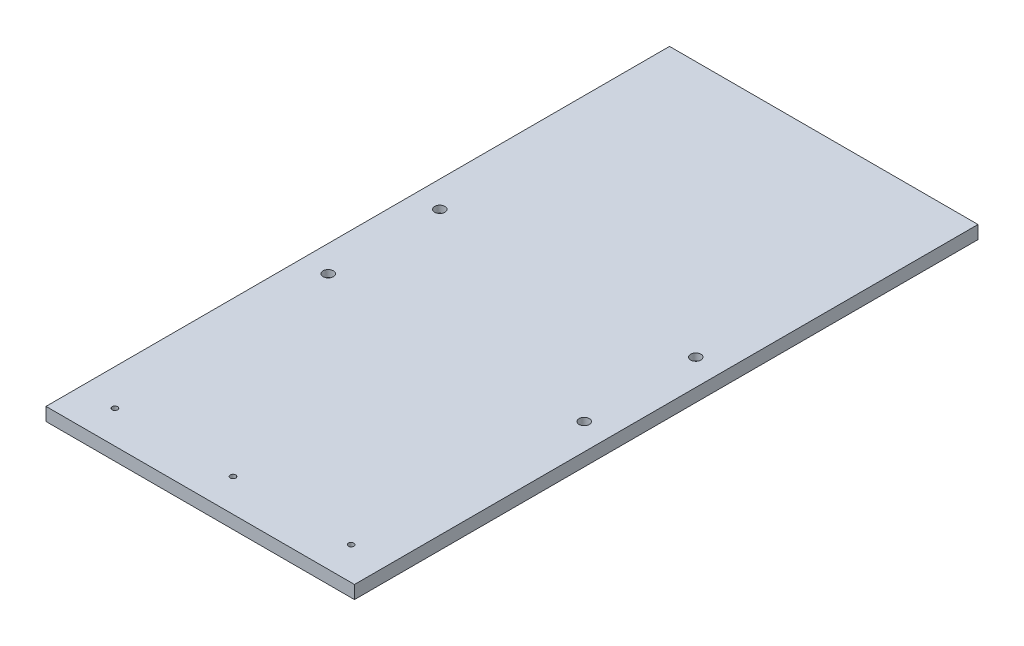
ISO-10303-21;
HEADER;
FILE_DESCRIPTION(('STEP AP214'),'2;1');
FILE_NAME('part.step','',(''),(''),'','','');
FILE_SCHEMA(('AUTOMOTIVE_DESIGN { 1 0 10303 214 1 1 1 1 }'));
ENDSEC;
DATA;
#1=APPLICATION_CONTEXT('core data for automotive mechanical design processes');
#2=APPLICATION_PROTOCOL_DEFINITION('international standard','automotive_design',2000,#1);
#3=PRODUCT_CONTEXT('',#1,'mechanical');
#4=PRODUCT('Part','Part','',(#3));
#5=PRODUCT_RELATED_PRODUCT_CATEGORY('part','',(#4));
#6=PRODUCT_DEFINITION_FORMATION('','',#4);
#7=PRODUCT_DEFINITION_CONTEXT('part definition',#1,'design');
#8=PRODUCT_DEFINITION('design','',#6,#7);
#9=PRODUCT_DEFINITION_SHAPE('','',#8);
#10=(LENGTH_UNIT() NAMED_UNIT(*) SI_UNIT(.MILLI.,.METRE.));
#11=(NAMED_UNIT(*) PLANE_ANGLE_UNIT() SI_UNIT($,.RADIAN.));
#12=(NAMED_UNIT(*) SI_UNIT($,.STERADIAN.) SOLID_ANGLE_UNIT());
#13=UNCERTAINTY_MEASURE_WITH_UNIT(LENGTH_MEASURE(1.E-05),#10,'distance_accuracy_value','');
#14=(GEOMETRIC_REPRESENTATION_CONTEXT(3) GLOBAL_UNCERTAINTY_ASSIGNED_CONTEXT((#13)) GLOBAL_UNIT_ASSIGNED_CONTEXT((#10,
#11,#12)) REPRESENTATION_CONTEXT('',''));
#15=CARTESIAN_POINT('',(0.,0.,0.));
#16=DIRECTION('',(0.,0.,1.));
#17=DIRECTION('',(1.,0.,0.));
#18=AXIS2_PLACEMENT_3D('',#15,#16,#17);
#19=CARTESIAN_POINT('',(123.825,-7.64579372036778E-13,53.975));
#20=DIRECTION('',(0.,-1.,0.));
#21=DIRECTION('',(0.,0.,-1.));
#22=AXIS2_PLACEMENT_3D('',#19,#20,#21);
#23=CONICAL_SURFACE('',#22,10.1345999999991,0.71558499331754);
#24=CARTESIAN_POINT('',(123.825,5.9461392600853,53.975));
#25=DIRECTION('',(0.,-1.,0.));
#26=DIRECTION('',(0.,0.,-1.));
#27=AXIS2_PLACEMENT_3D('',#24,#25,#26);
#28=CIRCLE('',#27,4.9657);
#29=CARTESIAN_POINT('',(123.825,5.9461392600853,49.0093));
#30=VERTEX_POINT('',#29);
#31=EDGE_CURVE('E93',#30,#30,#28,.F.);
#32=ORIENTED_EDGE('',*,*,#31,.T.);
#33=EDGE_LOOP('',(#32));
#34=FACE_BOUND('',#33,.T.);
#35=CARTESIAN_POINT('',(123.825,-7.56773116394882E-13,53.975));
#36=DIRECTION('',(0.,-1.,0.));
#37=DIRECTION('',(0.,0.,-1.));
#38=AXIS2_PLACEMENT_3D('',#35,#36,#37);
#39=CIRCLE('',#38,10.1345999999991);
#40=CARTESIAN_POINT('',(123.825,-7.56773116394882E-13,43.8404000000009));
#41=VERTEX_POINT('',#40);
#42=EDGE_CURVE('E20',#41,#41,#39,.T.);
#43=ORIENTED_EDGE('',*,*,#42,.T.);
#44=EDGE_LOOP('',(#43));
#45=FACE_BOUND('',#44,.T.);
#46=ADVANCED_FACE('F17',(#34,#45),#23,.F.);
#47=CARTESIAN_POINT('',(123.825,-7.64579372036778E-13,-53.975));
#48=DIRECTION('',(0.,-1.,0.));
#49=DIRECTION('',(0.,0.,-1.));
#50=AXIS2_PLACEMENT_3D('',#47,#48,#49);
#51=CONICAL_SURFACE('',#50,10.1345999999991,0.71558499331754);
#52=CARTESIAN_POINT('',(123.825,5.9461392600853,-53.975));
#53=DIRECTION('',(0.,-1.,0.));
#54=DIRECTION('',(0.,0.,-1.));
#55=AXIS2_PLACEMENT_3D('',#52,#53,#54);
#56=CIRCLE('',#55,4.9657);
#57=CARTESIAN_POINT('',(123.825,5.9461392600853,-58.9407));
#58=VERTEX_POINT('',#57);
#59=EDGE_CURVE('E90',#58,#58,#56,.F.);
#60=ORIENTED_EDGE('',*,*,#59,.T.);
#61=EDGE_LOOP('',(#60));
#62=FACE_BOUND('',#61,.T.);
#63=CARTESIAN_POINT('',(123.825,-7.56773116394882E-13,-53.975));
#64=DIRECTION('',(0.,-1.,0.));
#65=DIRECTION('',(0.,0.,-1.));
#66=AXIS2_PLACEMENT_3D('',#63,#64,#65);
#67=CIRCLE('',#66,10.1345999999991);
#68=CARTESIAN_POINT('',(123.825,-7.56773116394882E-13,-64.1095999999991));
#69=VERTEX_POINT('',#68);
#70=EDGE_CURVE('E128',#69,#69,#67,.T.);
#71=ORIENTED_EDGE('',*,*,#70,.T.);
#72=EDGE_LOOP('',(#71));
#73=FACE_BOUND('',#72,.T.);
#74=ADVANCED_FACE('F286',(#62,#73),#51,.F.);
#75=CARTESIAN_POINT('',(-123.825,-7.59375201608847E-13,53.975));
#76=DIRECTION('',(0.,-1.,0.));
#77=DIRECTION('',(0.,0.,-1.));
#78=AXIS2_PLACEMENT_3D('',#75,#76,#77);
#79=CONICAL_SURFACE('',#78,10.1345999999991,0.715584993317541);
#80=CARTESIAN_POINT('',(-123.825,5.9461392600853,53.975));
#81=DIRECTION('',(0.,-1.,0.));
#82=DIRECTION('',(0.,0.,-1.));
#83=AXIS2_PLACEMENT_3D('',#80,#81,#82);
#84=CIRCLE('',#83,4.9657);
#85=CARTESIAN_POINT('',(-123.825,5.9461392600853,49.0093));
#86=VERTEX_POINT('',#85);
#87=EDGE_CURVE('E87',#86,#86,#84,.F.);
#88=ORIENTED_EDGE('',*,*,#87,.T.);
#89=EDGE_LOOP('',(#88));
#90=FACE_BOUND('',#89,.T.);
#91=CARTESIAN_POINT('',(-123.825,-7.52869988573934E-13,53.975));
#92=DIRECTION('',(0.,-1.,0.));
#93=DIRECTION('',(0.,0.,-1.));
#94=AXIS2_PLACEMENT_3D('',#91,#92,#93);
#95=CIRCLE('',#94,10.1345999999991);
#96=CARTESIAN_POINT('',(-123.825,-7.52869988573934E-13,43.8404000000009));
#97=VERTEX_POINT('',#96);
#98=EDGE_CURVE('E126',#97,#97,#95,.T.);
#99=ORIENTED_EDGE('',*,*,#98,.T.);
#100=EDGE_LOOP('',(#99));
#101=FACE_BOUND('',#100,.T.);
#102=ADVANCED_FACE('F146',(#90,#101),#79,.F.);
#103=CARTESIAN_POINT('',(-123.825,-7.59375201608847E-13,-53.975));
#104=DIRECTION('',(0.,-1.,0.));
#105=DIRECTION('',(0.,0.,-1.));
#106=AXIS2_PLACEMENT_3D('',#103,#104,#105);
#107=CONICAL_SURFACE('',#106,10.1345999999991,0.715584993317541);
#108=CARTESIAN_POINT('',(-123.825,5.9461392600853,-53.975));
#109=DIRECTION('',(0.,-1.,0.));
#110=DIRECTION('',(0.,0.,-1.));
#111=AXIS2_PLACEMENT_3D('',#108,#109,#110);
#112=CIRCLE('',#111,4.9657);
#113=CARTESIAN_POINT('',(-123.825,5.9461392600853,-58.9407));
#114=VERTEX_POINT('',#113);
#115=EDGE_CURVE('E83',#114,#114,#112,.F.);
#116=ORIENTED_EDGE('',*,*,#115,.T.);
#117=EDGE_LOOP('',(#116));
#118=FACE_BOUND('',#117,.T.);
#119=CARTESIAN_POINT('',(-123.825,-7.52869988573934E-13,-53.975));
#120=DIRECTION('',(0.,-1.,0.));
#121=DIRECTION('',(0.,0.,-1.));
#122=AXIS2_PLACEMENT_3D('',#119,#120,#121);
#123=CIRCLE('',#122,10.1345999999991);
#124=CARTESIAN_POINT('',(-123.825,-7.52869988573934E-13,-64.1095999999991));
#125=VERTEX_POINT('',#124);
#126=EDGE_CURVE('E69',#125,#125,#123,.T.);
#127=ORIENTED_EDGE('',*,*,#126,.T.);
#128=EDGE_LOOP('',(#127));
#129=FACE_BOUND('',#128,.T.);
#130=ADVANCED_FACE('F137',(#118,#129),#107,.F.);
#131=CARTESIAN_POINT('',(0.,0.,0.));
#132=DIRECTION('',(0.,1.,0.));
#133=DIRECTION('',(0.,0.,1.));
#134=AXIS2_PLACEMENT_3D('',#131,#132,#133);
#135=PLANE('',#134);
#136=CARTESIAN_POINT('',(114.3,0.,269.875));
#137=DIRECTION('',(0.,1.,0.));
#138=DIRECTION('',(0.,0.,1.));
#139=AXIS2_PLACEMENT_3D('',#136,#137,#138);
#140=CIRCLE('',#139,2.667);
#141=CARTESIAN_POINT('',(114.3,0.,272.542));
#142=VERTEX_POINT('',#141);
#143=EDGE_CURVE('E115',#142,#142,#140,.T.);
#144=ORIENTED_EDGE('',*,*,#143,.T.);
#145=EDGE_LOOP('',(#144));
#146=FACE_BOUND('',#145,.T.);
#147=CARTESIAN_POINT('',(0.,0.,269.875));
#148=DIRECTION('',(0.,1.,0.));
#149=DIRECTION('',(0.,0.,1.));
#150=AXIS2_PLACEMENT_3D('',#147,#148,#149);
#151=CIRCLE('',#150,2.667);
#152=CARTESIAN_POINT('',(0.,0.,272.542));
#153=VERTEX_POINT('',#152);
#154=EDGE_CURVE('E119',#153,#153,#151,.T.);
#155=ORIENTED_EDGE('',*,*,#154,.T.);
#156=EDGE_LOOP('',(#155));
#157=FACE_BOUND('',#156,.T.);
#158=CARTESIAN_POINT('',(-114.3,0.,269.875));
#159=DIRECTION('',(0.,1.,0.));
#160=DIRECTION('',(0.,0.,1.));
#161=AXIS2_PLACEMENT_3D('',#158,#159,#160);
#162=CIRCLE('',#161,2.667);
#163=CARTESIAN_POINT('',(-114.3,0.,272.542));
#164=VERTEX_POINT('',#163);
#165=EDGE_CURVE('E86',#164,#164,#162,.T.);
#166=ORIENTED_EDGE('',*,*,#165,.T.);
#167=EDGE_LOOP('',(#166));
#168=FACE_BOUND('',#167,.T.);
#169=ORIENTED_EDGE('',*,*,#126,.F.);
#170=EDGE_LOOP('',(#169));
#171=FACE_BOUND('',#170,.T.);
#172=ORIENTED_EDGE('',*,*,#98,.F.);
#173=EDGE_LOOP('',(#172));
#174=FACE_BOUND('',#173,.T.);
#175=ORIENTED_EDGE('',*,*,#70,.F.);
#176=EDGE_LOOP('',(#175));
#177=FACE_BOUND('',#176,.T.);
#178=ORIENTED_EDGE('',*,*,#42,.F.);
#179=EDGE_LOOP('',(#178));
#180=FACE_BOUND('',#179,.T.);
#181=DIRECTION('',(-1.,0.,0.));
#182=VECTOR('',#181,1.);
#183=CARTESIAN_POINT('',(149.225,0.,-301.625));
#184=LINE('',#183,#182);
#185=CARTESIAN_POINT('',(149.225,0.,-301.625));
#186=VERTEX_POINT('',#185);
#187=CARTESIAN_POINT('',(-149.225,0.,-301.625));
#188=VERTEX_POINT('',#187);
#189=EDGE_CURVE('E55',#186,#188,#184,.T.);
#190=ORIENTED_EDGE('',*,*,#189,.F.);
#191=DIRECTION('',(0.,0.,-1.));
#192=VECTOR('',#191,1.);
#193=CARTESIAN_POINT('',(149.225,0.,301.625));
#194=LINE('',#193,#192);
#195=CARTESIAN_POINT('',(149.225,0.,301.625));
#196=VERTEX_POINT('',#195);
#197=EDGE_CURVE('E60',#196,#186,#194,.T.);
#198=ORIENTED_EDGE('',*,*,#197,.F.);
#199=DIRECTION('',(1.,0.,0.));
#200=VECTOR('',#199,1.);
#201=CARTESIAN_POINT('',(-149.225,0.,301.625));
#202=LINE('',#201,#200);
#203=CARTESIAN_POINT('',(-149.225,0.,301.625));
#204=VERTEX_POINT('',#203);
#205=EDGE_CURVE('E95',#204,#196,#202,.T.);
#206=ORIENTED_EDGE('',*,*,#205,.F.);
#207=DIRECTION('',(0.,0.,1.));
#208=VECTOR('',#207,1.);
#209=CARTESIAN_POINT('',(-149.225,0.,-301.625));
#210=LINE('',#209,#208);
#211=EDGE_CURVE('E72',#188,#204,#210,.T.);
#212=ORIENTED_EDGE('',*,*,#211,.F.);
#213=EDGE_LOOP('',(#190,#198,#206,#212));
#214=FACE_BOUND('',#213,.T.);
#215=ADVANCED_FACE('F71',(#146,#157,#168,#171,#174,#177,#180,#214),#135,.F.);
#216=CARTESIAN_POINT('',(149.225,0.,301.625));
#217=DIRECTION('',(1.,0.,0.));
#218=DIRECTION('',(0.,0.,-1.));
#219=AXIS2_PLACEMENT_3D('',#216,#217,#218);
#220=PLANE('',#219);
#221=DIRECTION('',(0.,1.,0.));
#222=VECTOR('',#221,1.);
#223=CARTESIAN_POINT('',(149.225,0.,301.625));
#224=LINE('',#223,#222);
#225=CARTESIAN_POINT('',(149.225,12.7,301.625));
#226=VERTEX_POINT('',#225);
#227=EDGE_CURVE('E65',#196,#226,#224,.T.);
#228=ORIENTED_EDGE('',*,*,#227,.F.);
#229=ORIENTED_EDGE('',*,*,#197,.T.);
#230=DIRECTION('',(0.,1.,0.));
#231=VECTOR('',#230,1.);
#232=CARTESIAN_POINT('',(149.225,0.,-301.625));
#233=LINE('',#232,#231);
#234=CARTESIAN_POINT('',(149.225,12.7,-301.625));
#235=VERTEX_POINT('',#234);
#236=EDGE_CURVE('E62',#235,#186,#233,.F.);
#237=ORIENTED_EDGE('',*,*,#236,.F.);
#238=DIRECTION('',(0.,0.,1.));
#239=VECTOR('',#238,1.);
#240=CARTESIAN_POINT('',(149.225,12.7,0.));
#241=LINE('',#240,#239);
#242=EDGE_CURVE('E118',#226,#235,#241,.F.);
#243=ORIENTED_EDGE('',*,*,#242,.F.);
#244=EDGE_LOOP('',(#228,#229,#237,#243));
#245=FACE_BOUND('',#244,.T.);
#246=ADVANCED_FACE('F61',(#245),#220,.T.);
#247=CARTESIAN_POINT('',(149.225,0.,-301.625));
#248=DIRECTION('',(0.,0.,-1.));
#249=DIRECTION('',(-1.,0.,0.));
#250=AXIS2_PLACEMENT_3D('',#247,#248,#249);
#251=PLANE('',#250);
#252=ORIENTED_EDGE('',*,*,#236,.T.);
#253=ORIENTED_EDGE('',*,*,#189,.T.);
#254=DIRECTION('',(0.,1.,0.));
#255=VECTOR('',#254,1.);
#256=CARTESIAN_POINT('',(-149.225,0.,-301.625));
#257=LINE('',#256,#255);
#258=CARTESIAN_POINT('',(-149.225,12.7,-301.625));
#259=VERTEX_POINT('',#258);
#260=EDGE_CURVE('E74',#259,#188,#257,.F.);
#261=ORIENTED_EDGE('',*,*,#260,.F.);
#262=DIRECTION('',(1.,0.,0.));
#263=VECTOR('',#262,1.);
#264=CARTESIAN_POINT('',(0.,12.7,-301.625));
#265=LINE('',#264,#263);
#266=EDGE_CURVE('E78',#235,#259,#265,.F.);
#267=ORIENTED_EDGE('',*,*,#266,.F.);
#268=EDGE_LOOP('',(#252,#253,#261,#267));
#269=FACE_BOUND('',#268,.T.);
#270=ADVANCED_FACE('F76',(#269),#251,.T.);
#271=CARTESIAN_POINT('',(-149.225,0.,-301.625));
#272=DIRECTION('',(-1.,0.,0.));
#273=DIRECTION('',(0.,0.,1.));
#274=AXIS2_PLACEMENT_3D('',#271,#272,#273);
#275=PLANE('',#274);
#276=ORIENTED_EDGE('',*,*,#260,.T.);
#277=ORIENTED_EDGE('',*,*,#211,.T.);
#278=DIRECTION('',(0.,1.,0.));
#279=VECTOR('',#278,1.);
#280=CARTESIAN_POINT('',(-149.225,0.,301.625));
#281=LINE('',#280,#279);
#282=CARTESIAN_POINT('',(-149.225,12.7,301.625));
#283=VERTEX_POINT('',#282);
#284=EDGE_CURVE('E35',#283,#204,#281,.F.);
#285=ORIENTED_EDGE('',*,*,#284,.F.);
#286=DIRECTION('',(0.,0.,1.));
#287=VECTOR('',#286,1.);
#288=CARTESIAN_POINT('',(-149.225,12.7,0.));
#289=LINE('',#288,#287);
#290=EDGE_CURVE('E314',#259,#283,#289,.T.);
#291=ORIENTED_EDGE('',*,*,#290,.F.);
#292=EDGE_LOOP('',(#276,#277,#285,#291));
#293=FACE_BOUND('',#292,.T.);
#294=ADVANCED_FACE('F189',(#293),#275,.T.);
#295=CARTESIAN_POINT('',(-149.225,0.,301.625));
#296=DIRECTION('',(0.,0.,1.));
#297=DIRECTION('',(1.,0.,0.));
#298=AXIS2_PLACEMENT_3D('',#295,#296,#297);
#299=PLANE('',#298);
#300=ORIENTED_EDGE('',*,*,#284,.T.);
#301=ORIENTED_EDGE('',*,*,#205,.T.);
#302=ORIENTED_EDGE('',*,*,#227,.T.);
#303=DIRECTION('',(1.,0.,0.));
#304=VECTOR('',#303,1.);
#305=CARTESIAN_POINT('',(0.,12.7,301.625));
#306=LINE('',#305,#304);
#307=EDGE_CURVE('E114',#283,#226,#306,.T.);
#308=ORIENTED_EDGE('',*,*,#307,.F.);
#309=EDGE_LOOP('',(#300,#301,#302,#308));
#310=FACE_BOUND('',#309,.T.);
#311=ADVANCED_FACE('F185',(#310),#299,.T.);
#312=CARTESIAN_POINT('',(123.825,14.6685,53.975));
#313=DIRECTION('',(0.,-1.,0.));
#314=DIRECTION('',(0.,0.,-1.));
#315=AXIS2_PLACEMENT_3D('',#312,#313,#314);
#316=CYLINDRICAL_SURFACE('',#315,4.9657);
#317=ORIENTED_EDGE('',*,*,#31,.F.);
#318=EDGE_LOOP('',(#317));
#319=FACE_BOUND('',#318,.T.);
#320=CARTESIAN_POINT('',(123.825,12.7,53.975));
#321=DIRECTION('',(0.,-1.,0.));
#322=DIRECTION('',(0.,0.,-1.));
#323=AXIS2_PLACEMENT_3D('',#320,#321,#322);
#324=CIRCLE('',#323,4.9657);
#325=CARTESIAN_POINT('',(123.825,12.7,49.0093));
#326=VERTEX_POINT('',#325);
#327=EDGE_CURVE('E111',#326,#326,#324,.T.);
#328=ORIENTED_EDGE('',*,*,#327,.F.);
#329=EDGE_LOOP('',(#328));
#330=FACE_BOUND('',#329,.T.);
#331=ADVANCED_FACE('F181',(#319,#330),#316,.F.);
#332=CARTESIAN_POINT('',(123.825,14.6685,-53.975));
#333=DIRECTION('',(0.,-1.,0.));
#334=DIRECTION('',(0.,0.,-1.));
#335=AXIS2_PLACEMENT_3D('',#332,#333,#334);
#336=CYLINDRICAL_SURFACE('',#335,4.9657);
#337=ORIENTED_EDGE('',*,*,#59,.F.);
#338=EDGE_LOOP('',(#337));
#339=FACE_BOUND('',#338,.T.);
#340=CARTESIAN_POINT('',(123.825,12.7,-53.975));
#341=DIRECTION('',(0.,-1.,0.));
#342=DIRECTION('',(0.,0.,-1.));
#343=AXIS2_PLACEMENT_3D('',#340,#341,#342);
#344=CIRCLE('',#343,4.9657);
#345=CARTESIAN_POINT('',(123.825,12.7,-58.9407));
#346=VERTEX_POINT('',#345);
#347=EDGE_CURVE('E108',#346,#346,#344,.T.);
#348=ORIENTED_EDGE('',*,*,#347,.F.);
#349=EDGE_LOOP('',(#348));
#350=FACE_BOUND('',#349,.T.);
#351=ADVANCED_FACE('F177',(#339,#350),#336,.F.);
#352=CARTESIAN_POINT('',(-123.825,14.6685,53.975));
#353=DIRECTION('',(0.,-1.,0.));
#354=DIRECTION('',(0.,0.,-1.));
#355=AXIS2_PLACEMENT_3D('',#352,#353,#354);
#356=CYLINDRICAL_SURFACE('',#355,4.9657);
#357=ORIENTED_EDGE('',*,*,#87,.F.);
#358=EDGE_LOOP('',(#357));
#359=FACE_BOUND('',#358,.T.);
#360=CARTESIAN_POINT('',(-123.825,12.7,53.975));
#361=DIRECTION('',(0.,-1.,0.));
#362=DIRECTION('',(0.,0.,-1.));
#363=AXIS2_PLACEMENT_3D('',#360,#361,#362);
#364=CIRCLE('',#363,4.9657);
#365=CARTESIAN_POINT('',(-123.825,12.7,49.0093));
#366=VERTEX_POINT('',#365);
#367=EDGE_CURVE('E105',#366,#366,#364,.T.);
#368=ORIENTED_EDGE('',*,*,#367,.F.);
#369=EDGE_LOOP('',(#368));
#370=FACE_BOUND('',#369,.T.);
#371=ADVANCED_FACE('F173',(#359,#370),#356,.F.);
#372=CARTESIAN_POINT('',(-123.825,14.6685,-53.975));
#373=DIRECTION('',(0.,-1.,0.));
#374=DIRECTION('',(0.,0.,-1.));
#375=AXIS2_PLACEMENT_3D('',#372,#373,#374);
#376=CYLINDRICAL_SURFACE('',#375,4.9657);
#377=ORIENTED_EDGE('',*,*,#115,.F.);
#378=EDGE_LOOP('',(#377));
#379=FACE_BOUND('',#378,.T.);
#380=CARTESIAN_POINT('',(-123.825,12.7,-53.975));
#381=DIRECTION('',(0.,-1.,0.));
#382=DIRECTION('',(0.,0.,-1.));
#383=AXIS2_PLACEMENT_3D('',#380,#381,#382);
#384=CIRCLE('',#383,4.9657);
#385=CARTESIAN_POINT('',(-123.825,12.7,-58.9407));
#386=VERTEX_POINT('',#385);
#387=EDGE_CURVE('E102',#386,#386,#384,.T.);
#388=ORIENTED_EDGE('',*,*,#387,.F.);
#389=EDGE_LOOP('',(#388));
#390=FACE_BOUND('',#389,.T.);
#391=ADVANCED_FACE('F169',(#379,#390),#376,.F.);
#392=CARTESIAN_POINT('',(-114.3,12.7,269.875));
#393=DIRECTION('',(0.,1.,0.));
#394=DIRECTION('',(0.,0.,1.));
#395=AXIS2_PLACEMENT_3D('',#392,#393,#394);
#396=CYLINDRICAL_SURFACE('',#395,2.667);
#397=CARTESIAN_POINT('',(-114.3,12.7,269.875));
#398=DIRECTION('',(0.,1.,0.));
#399=DIRECTION('',(0.,0.,1.));
#400=AXIS2_PLACEMENT_3D('',#397,#398,#399);
#401=CIRCLE('',#400,2.667);
#402=CARTESIAN_POINT('',(-114.3,12.7,272.542));
#403=VERTEX_POINT('',#402);
#404=EDGE_CURVE('E99',#403,#403,#401,.F.);
#405=ORIENTED_EDGE('',*,*,#404,.F.);
#406=EDGE_LOOP('',(#405));
#407=FACE_BOUND('',#406,.T.);
#408=ORIENTED_EDGE('',*,*,#165,.F.);
#409=EDGE_LOOP('',(#408));
#410=FACE_BOUND('',#409,.T.);
#411=ADVANCED_FACE('F165',(#407,#410),#396,.F.);
#412=CARTESIAN_POINT('',(0.,12.7,269.875));
#413=DIRECTION('',(0.,1.,0.));
#414=DIRECTION('',(0.,0.,1.));
#415=AXIS2_PLACEMENT_3D('',#412,#413,#414);
#416=CYLINDRICAL_SURFACE('',#415,2.667);
#417=CARTESIAN_POINT('',(0.,12.7,269.875));
#418=DIRECTION('',(0.,1.,0.));
#419=DIRECTION('',(0.,0.,1.));
#420=AXIS2_PLACEMENT_3D('',#417,#418,#419);
#421=CIRCLE('',#420,2.667);
#422=CARTESIAN_POINT('',(0.,12.7,272.542));
#423=VERTEX_POINT('',#422);
#424=EDGE_CURVE('E26',#423,#423,#421,.F.);
#425=ORIENTED_EDGE('',*,*,#424,.F.);
#426=EDGE_LOOP('',(#425));
#427=FACE_BOUND('',#426,.T.);
#428=ORIENTED_EDGE('',*,*,#154,.F.);
#429=EDGE_LOOP('',(#428));
#430=FACE_BOUND('',#429,.T.);
#431=ADVANCED_FACE('F158',(#427,#430),#416,.F.);
#432=CARTESIAN_POINT('',(114.3,12.7,269.875));
#433=DIRECTION('',(0.,1.,0.));
#434=DIRECTION('',(0.,0.,1.));
#435=AXIS2_PLACEMENT_3D('',#432,#433,#434);
#436=CYLINDRICAL_SURFACE('',#435,2.667);
#437=CARTESIAN_POINT('',(114.3,12.7,269.875));
#438=DIRECTION('',(0.,1.,0.));
#439=DIRECTION('',(0.,0.,1.));
#440=AXIS2_PLACEMENT_3D('',#437,#438,#439);
#441=CIRCLE('',#440,2.667);
#442=CARTESIAN_POINT('',(114.3,12.7,272.542));
#443=VERTEX_POINT('',#442);
#444=EDGE_CURVE('E11',#443,#443,#441,.F.);
#445=ORIENTED_EDGE('',*,*,#444,.F.);
#446=EDGE_LOOP('',(#445));
#447=FACE_BOUND('',#446,.T.);
#448=ORIENTED_EDGE('',*,*,#143,.F.);
#449=EDGE_LOOP('',(#448));
#450=FACE_BOUND('',#449,.T.);
#451=ADVANCED_FACE('F152',(#447,#450),#436,.F.);
#452=CARTESIAN_POINT('',(0.,12.7,0.));
#453=DIRECTION('',(0.,1.,0.));
#454=DIRECTION('',(0.,0.,1.));
#455=AXIS2_PLACEMENT_3D('',#452,#453,#454);
#456=PLANE('',#455);
#457=ORIENTED_EDGE('',*,*,#444,.T.);
#458=EDGE_LOOP('',(#457));
#459=FACE_BOUND('',#458,.T.);
#460=ORIENTED_EDGE('',*,*,#424,.T.);
#461=EDGE_LOOP('',(#460));
#462=FACE_BOUND('',#461,.T.);
#463=ORIENTED_EDGE('',*,*,#404,.T.);
#464=EDGE_LOOP('',(#463));
#465=FACE_BOUND('',#464,.T.);
#466=ORIENTED_EDGE('',*,*,#387,.T.);
#467=EDGE_LOOP('',(#466));
#468=FACE_BOUND('',#467,.T.);
#469=ORIENTED_EDGE('',*,*,#367,.T.);
#470=EDGE_LOOP('',(#469));
#471=FACE_BOUND('',#470,.T.);
#472=ORIENTED_EDGE('',*,*,#347,.T.);
#473=EDGE_LOOP('',(#472));
#474=FACE_BOUND('',#473,.T.);
#475=ORIENTED_EDGE('',*,*,#327,.T.);
#476=EDGE_LOOP('',(#475));
#477=FACE_BOUND('',#476,.T.);
#478=ORIENTED_EDGE('',*,*,#290,.T.);
#479=ORIENTED_EDGE('',*,*,#307,.T.);
#480=ORIENTED_EDGE('',*,*,#242,.T.);
#481=ORIENTED_EDGE('',*,*,#266,.T.);
#482=EDGE_LOOP('',(#478,#479,#480,#481));
#483=FACE_BOUND('',#482,.T.);
#484=ADVANCED_FACE('F150',(#459,#462,#465,#468,#471,#474,#477,#483),#456,.T.);
#485=CLOSED_SHELL('',(#46,#74,#102,#130,#215,#246,#270,#294,#311,#331,#351,#371,#391,#411,#431,
#451,#484));
#486=MANIFOLD_SOLID_BREP('B1',#485);
#487=ADVANCED_BREP_SHAPE_REPRESENTATION('',(#18,#486),#14);
#488=SHAPE_DEFINITION_REPRESENTATION(#9,#487);
ENDSEC;
END-ISO-10303-21;
